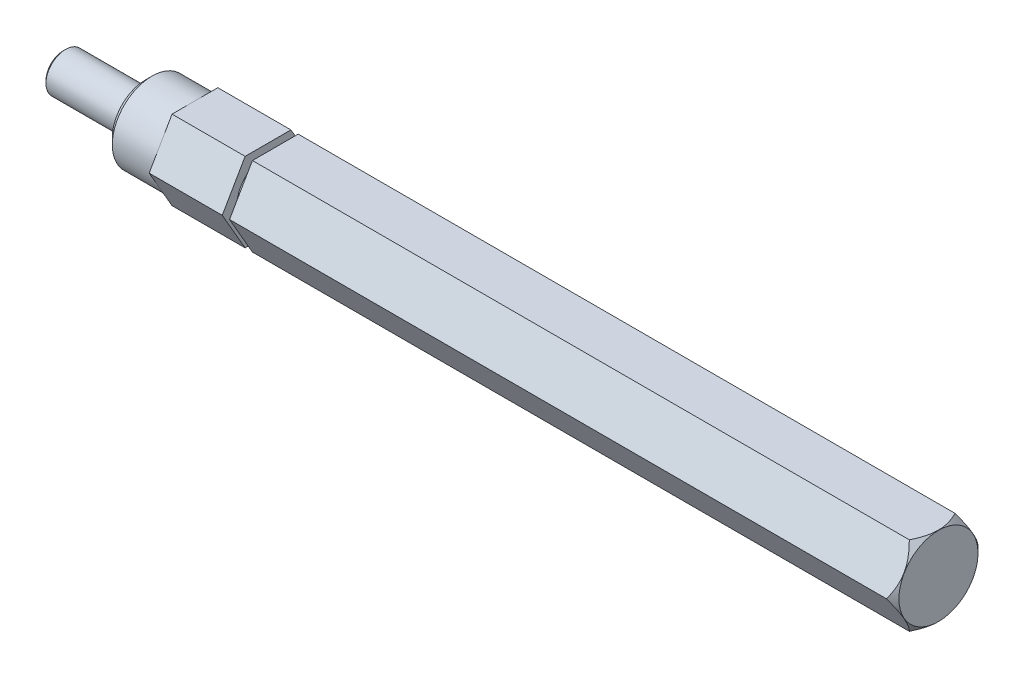
ISO-10303-21;
HEADER;
FILE_DESCRIPTION(('STEP AP214'),'2;1');
FILE_NAME('part.step','',(''),(''),'','','');
FILE_SCHEMA(('AUTOMOTIVE_DESIGN { 1 0 10303 214 1 1 1 1 }'));
ENDSEC;
DATA;
#1=APPLICATION_CONTEXT('core data for automotive mechanical design processes');
#2=APPLICATION_PROTOCOL_DEFINITION('international standard','automotive_design',2000,#1);
#3=PRODUCT_CONTEXT('',#1,'mechanical');
#4=PRODUCT('Part','Part','',(#3));
#5=PRODUCT_RELATED_PRODUCT_CATEGORY('part','',(#4));
#6=PRODUCT_DEFINITION_FORMATION('','',#4);
#7=PRODUCT_DEFINITION_CONTEXT('part definition',#1,'design');
#8=PRODUCT_DEFINITION('design','',#6,#7);
#9=PRODUCT_DEFINITION_SHAPE('','',#8);
#10=(LENGTH_UNIT() NAMED_UNIT(*) SI_UNIT(.MILLI.,.METRE.));
#11=(NAMED_UNIT(*) PLANE_ANGLE_UNIT() SI_UNIT($,.RADIAN.));
#12=(NAMED_UNIT(*) SI_UNIT($,.STERADIAN.) SOLID_ANGLE_UNIT());
#13=UNCERTAINTY_MEASURE_WITH_UNIT(LENGTH_MEASURE(1.E-05),#10,'distance_accuracy_value','');
#14=(GEOMETRIC_REPRESENTATION_CONTEXT(3) GLOBAL_UNCERTAINTY_ASSIGNED_CONTEXT((#13)) GLOBAL_UNIT_ASSIGNED_CONTEXT((#10,
#11,#12)) REPRESENTATION_CONTEXT('',''));
#15=CARTESIAN_POINT('',(0.,0.,0.));
#16=DIRECTION('',(0.,0.,1.));
#17=DIRECTION('',(1.,0.,0.));
#18=AXIS2_PLACEMENT_3D('',#15,#16,#17);
#19=CARTESIAN_POINT('',(-76.708,0.,0.));
#20=DIRECTION('',(-1.,0.,0.));
#21=DIRECTION('',(0.,0.,1.));
#22=AXIS2_PLACEMENT_3D('',#19,#20,#21);
#23=PLANE('',#22);
#24=CARTESIAN_POINT('',(-76.7079999999964,0.,0.));
#25=DIRECTION('',(1.,0.,0.));
#26=DIRECTION('',(0.,0.,-1.));
#27=AXIS2_PLACEMENT_3D('',#24,#25,#26);
#28=CIRCLE('',#27,2.76860000002443);
#29=CARTESIAN_POINT('',(-76.7079999999964,0.,-2.76860000002443));
#30=VERTEX_POINT('',#29);
#31=EDGE_CURVE('E21',#30,#30,#28,.T.);
#32=ORIENTED_EDGE('',*,*,#31,.F.);
#33=EDGE_LOOP('',(#32));
#34=FACE_BOUND('',#33,.T.);
#35=ADVANCED_FACE('F18',(#34),#23,.T.);
#36=CARTESIAN_POINT('',(-76.326999999992,0.,0.));
#37=DIRECTION('',(1.,0.,0.));
#38=DIRECTION('',(0.,0.,-1.));
#39=AXIS2_PLACEMENT_3D('',#36,#37,#38);
#40=CONICAL_SURFACE('',#39,3.149599999972,0.785398163322851);
#41=ORIENTED_EDGE('',*,*,#31,.T.);
#42=EDGE_LOOP('',(#41));
#43=FACE_BOUND('',#42,.T.);
#44=CARTESIAN_POINT('',(-76.327,0.,0.));
#45=DIRECTION('',(1.,0.,0.));
#46=DIRECTION('',(0.,0.,-1.));
#47=AXIS2_PLACEMENT_3D('',#44,#45,#46);
#48=CIRCLE('',#47,3.1496);
#49=CARTESIAN_POINT('',(-76.327,0.,-3.1496));
#50=VERTEX_POINT('',#49);
#51=EDGE_CURVE('E134',#50,#50,#48,.T.);
#52=ORIENTED_EDGE('',*,*,#51,.F.);
#53=EDGE_LOOP('',(#52));
#54=FACE_BOUND('',#53,.T.);
#55=ADVANCED_FACE('F260',(#43,#54),#40,.T.);
#56=CARTESIAN_POINT('',(-76.708,0.,0.));
#57=DIRECTION('',(1.,0.,0.));
#58=DIRECTION('',(0.,0.,-1.));
#59=AXIS2_PLACEMENT_3D('',#56,#57,#58);
#60=CYLINDRICAL_SURFACE('',#59,3.1496);
#61=ORIENTED_EDGE('',*,*,#51,.T.);
#62=EDGE_LOOP('',(#61));
#63=FACE_BOUND('',#62,.T.);
#64=CARTESIAN_POINT('',(-63.5,0.,0.));
#65=DIRECTION('',(1.,0.,0.));
#66=DIRECTION('',(0.,0.,-1.));
#67=AXIS2_PLACEMENT_3D('',#64,#65,#66);
#68=CIRCLE('',#67,3.1496);
#69=CARTESIAN_POINT('',(-63.5,0.,-3.1496));
#70=VERTEX_POINT('',#69);
#71=EDGE_CURVE('E137',#70,#70,#68,.F.);
#72=ORIENTED_EDGE('',*,*,#71,.T.);
#73=EDGE_LOOP('',(#72));
#74=FACE_BOUND('',#73,.T.);
#75=ADVANCED_FACE('F257',(#63,#74),#60,.T.);
#76=CARTESIAN_POINT('',(-63.5,0.,-7.33234841870824));
#77=DIRECTION('',(1.,0.,0.));
#78=DIRECTION('',(0.,0.,-1.));
#79=AXIS2_PLACEMENT_3D('',#76,#77,#78);
#80=PLANE('',#79);
#81=ORIENTED_EDGE('',*,*,#71,.F.);
#82=EDGE_LOOP('',(#81));
#83=FACE_BOUND('',#82,.T.);
#84=CARTESIAN_POINT('',(-63.4999999999764,0.,0.));
#85=DIRECTION('',(1.,0.,0.));
#86=DIRECTION('',(0.,0.,-1.));
#87=AXIS2_PLACEMENT_3D('',#84,#85,#86);
#88=CIRCLE('',#87,5.35000000002128);
#89=CARTESIAN_POINT('',(-63.4999999999764,0.,-5.35000000002128));
#90=VERTEX_POINT('',#89);
#91=EDGE_CURVE('E133',#90,#90,#88,.T.);
#92=ORIENTED_EDGE('',*,*,#91,.F.);
#93=EDGE_LOOP('',(#92));
#94=FACE_BOUND('',#93,.T.);
#95=ADVANCED_FACE('F253',(#83,#94),#80,.F.);
#96=CARTESIAN_POINT('',(-62.5000000001137,0.,0.));
#97=DIRECTION('',(1.,0.,0.));
#98=DIRECTION('',(0.,0.,-1.));
#99=AXIS2_PLACEMENT_3D('',#96,#97,#98);
#100=CONICAL_SURFACE('',#99,6.34999999988395,0.785398163397448);
#101=ORIENTED_EDGE('',*,*,#91,.T.);
#102=EDGE_LOOP('',(#101));
#103=FACE_BOUND('',#102,.T.);
#104=CARTESIAN_POINT('',(-62.5,0.,0.));
#105=DIRECTION('',(-1.,0.,0.));
#106=DIRECTION('',(0.,0.,1.));
#107=AXIS2_PLACEMENT_3D('',#104,#105,#106);
#108=CIRCLE('',#107,6.35);
#109=CARTESIAN_POINT('',(-62.5,0.,6.35));
#110=VERTEX_POINT('',#109);
#111=EDGE_CURVE('E97',#110,#110,#108,.F.);
#112=ORIENTED_EDGE('',*,*,#111,.F.);
#113=EDGE_LOOP('',(#112));
#114=FACE_BOUND('',#113,.T.);
#115=ADVANCED_FACE('F250',(#103,#114),#100,.T.);
#116=CARTESIAN_POINT('',(-55.6133,0.,0.));
#117=DIRECTION('',(-1.,0.,0.));
#118=DIRECTION('',(0.,0.,1.));
#119=AXIS2_PLACEMENT_3D('',#116,#117,#118);
#120=CYLINDRICAL_SURFACE('',#119,6.35);
#121=CARTESIAN_POINT('',(-55.6133,0.,0.));
#122=DIRECTION('',(-1.,0.,0.));
#123=DIRECTION('',(0.,0.,1.));
#124=AXIS2_PLACEMENT_3D('',#121,#122,#123);
#125=CIRCLE('',#124,6.35);
#126=CARTESIAN_POINT('',(-55.6133,-3.17499999999999,-5.49926131403119));
#127=VERTEX_POINT('',#126);
#128=CARTESIAN_POINT('',(-55.6133,3.175,-5.49926131403119));
#129=VERTEX_POINT('',#128);
#130=EDGE_CURVE('E83',#127,#129,#125,.F.);
#131=ORIENTED_EDGE('',*,*,#130,.F.);
#132=CARTESIAN_POINT('',(-55.6133,0.,0.));
#133=DIRECTION('',(-1.,0.,0.));
#134=DIRECTION('',(0.,0.,1.));
#135=AXIS2_PLACEMENT_3D('',#132,#133,#134);
#136=CIRCLE('',#135,6.35);
#137=CARTESIAN_POINT('',(-55.6133,-6.35000000000001,0.));
#138=VERTEX_POINT('',#137);
#139=EDGE_CURVE('E92',#138,#127,#136,.F.);
#140=ORIENTED_EDGE('',*,*,#139,.F.);
#141=CARTESIAN_POINT('',(-55.6133,0.,0.));
#142=DIRECTION('',(-1.,0.,0.));
#143=DIRECTION('',(0.,0.,1.));
#144=AXIS2_PLACEMENT_3D('',#141,#142,#143);
#145=CIRCLE('',#144,6.35);
#146=CARTESIAN_POINT('',(-55.6133,-3.175,5.49926131403118));
#147=VERTEX_POINT('',#146);
#148=EDGE_CURVE('E107',#147,#138,#145,.F.);
#149=ORIENTED_EDGE('',*,*,#148,.F.);
#150=CARTESIAN_POINT('',(-55.6133,0.,0.));
#151=DIRECTION('',(-1.,0.,0.));
#152=DIRECTION('',(0.,0.,1.));
#153=AXIS2_PLACEMENT_3D('',#150,#151,#152);
#154=CIRCLE('',#153,6.35);
#155=CARTESIAN_POINT('',(-55.6133,3.17499999999999,5.49926131403118));
#156=VERTEX_POINT('',#155);
#157=EDGE_CURVE('E108',#156,#147,#154,.F.);
#158=ORIENTED_EDGE('',*,*,#157,.F.);
#159=CARTESIAN_POINT('',(-55.6133,0.,0.));
#160=DIRECTION('',(-1.,0.,0.));
#161=DIRECTION('',(0.,0.,1.));
#162=AXIS2_PLACEMENT_3D('',#159,#160,#161);
#163=CIRCLE('',#162,6.35);
#164=CARTESIAN_POINT('',(-55.6133,6.35,0.));
#165=VERTEX_POINT('',#164);
#166=EDGE_CURVE('E457',#165,#156,#163,.F.);
#167=ORIENTED_EDGE('',*,*,#166,.F.);
#168=CARTESIAN_POINT('',(-55.6133,0.,0.));
#169=DIRECTION('',(-1.,0.,0.));
#170=DIRECTION('',(0.,0.,1.));
#171=AXIS2_PLACEMENT_3D('',#168,#169,#170);
#172=CIRCLE('',#171,6.35);
#173=EDGE_CURVE('E95',#129,#165,#172,.F.);
#174=ORIENTED_EDGE('',*,*,#173,.F.);
#175=EDGE_LOOP('',(#131,#140,#149,#158,#167,#174));
#176=FACE_BOUND('',#175,.T.);
#177=ORIENTED_EDGE('',*,*,#111,.T.);
#178=EDGE_LOOP('',(#177));
#179=FACE_BOUND('',#178,.T.);
#180=ADVANCED_FACE('F89',(#176,#179),#120,.T.);
#181=CARTESIAN_POINT('',(-55.6133,0.,0.));
#182=DIRECTION('',(-1.,0.,0.));
#183=DIRECTION('',(0.,0.,1.));
#184=AXIS2_PLACEMENT_3D('',#181,#182,#183);
#185=PLANE('',#184);
#186=DIRECTION('',(0.,-0.86602540378444,0.499999999999998));
#187=VECTOR('',#186,1.);
#188=CARTESIAN_POINT('',(-55.6133,-6.35000000000002,-3.66617420935411));
#189=LINE('',#188,#187);
#190=CARTESIAN_POINT('',(-55.6133000000001,0.,-7.33234841870823));
#191=VERTEX_POINT('',#190);
#192=EDGE_CURVE('E114',#191,#127,#189,.T.);
#193=ORIENTED_EDGE('',*,*,#192,.T.);
#194=ORIENTED_EDGE('',*,*,#130,.T.);
#195=DIRECTION('',(0.,-0.866025403784439,-0.5));
#196=VECTOR('',#195,1.);
#197=CARTESIAN_POINT('',(-55.6133000000001,0.,-7.33234841870824));
#198=LINE('',#197,#196);
#199=EDGE_CURVE('E122',#129,#191,#198,.T.);
#200=ORIENTED_EDGE('',*,*,#199,.T.);
#201=EDGE_LOOP('',(#193,#194,#200));
#202=FACE_BOUND('',#201,.T.);
#203=ADVANCED_FACE('F121',(#202),#185,.T.);
#204=CARTESIAN_POINT('',(-55.6133,0.,0.));
#205=DIRECTION('',(-1.,0.,0.));
#206=DIRECTION('',(0.,0.,1.));
#207=AXIS2_PLACEMENT_3D('',#204,#205,#206);
#208=PLANE('',#207);
#209=DIRECTION('',(0.,-0.866025403784439,-0.5));
#210=VECTOR('',#209,1.);
#211=CARTESIAN_POINT('',(-55.6133000000001,0.,-7.33234841870824));
#212=LINE('',#211,#210);
#213=CARTESIAN_POINT('',(-55.6133,6.35000000000001,-3.66617420935409));
#214=VERTEX_POINT('',#213);
#215=EDGE_CURVE('E119',#214,#129,#212,.T.);
#216=ORIENTED_EDGE('',*,*,#215,.T.);
#217=ORIENTED_EDGE('',*,*,#173,.T.);
#218=DIRECTION('',(0.,0.,-1.));
#219=VECTOR('',#218,1.);
#220=CARTESIAN_POINT('',(-55.6133,6.35,-3.66617420935412));
#221=LINE('',#220,#219);
#222=EDGE_CURVE('E416',#165,#214,#221,.T.);
#223=ORIENTED_EDGE('',*,*,#222,.T.);
#224=EDGE_LOOP('',(#216,#217,#223));
#225=FACE_BOUND('',#224,.T.);
#226=ADVANCED_FACE('F241',(#225),#208,.T.);
#227=CARTESIAN_POINT('',(-55.6133,0.,0.));
#228=DIRECTION('',(-1.,0.,0.));
#229=DIRECTION('',(0.,0.,1.));
#230=AXIS2_PLACEMENT_3D('',#227,#228,#229);
#231=PLANE('',#230);
#232=ORIENTED_EDGE('',*,*,#166,.T.);
#233=DIRECTION('',(0.,0.866025403784439,-0.499999999999999));
#234=VECTOR('',#233,1.);
#235=CARTESIAN_POINT('',(-55.6133,6.35,3.6661742093541));
#236=LINE('',#235,#234);
#237=CARTESIAN_POINT('',(-55.6133,6.34999999999999,3.66617420935411));
#238=VERTEX_POINT('',#237);
#239=EDGE_CURVE('E401',#156,#238,#236,.T.);
#240=ORIENTED_EDGE('',*,*,#239,.T.);
#241=DIRECTION('',(0.,0.,-1.));
#242=VECTOR('',#241,1.);
#243=CARTESIAN_POINT('',(-55.6133,6.35,-3.66617420935412));
#244=LINE('',#243,#242);
#245=EDGE_CURVE('E413',#238,#165,#244,.T.);
#246=ORIENTED_EDGE('',*,*,#245,.T.);
#247=EDGE_LOOP('',(#232,#240,#246));
#248=FACE_BOUND('',#247,.T.);
#249=ADVANCED_FACE('F237',(#248),#231,.T.);
#250=CARTESIAN_POINT('',(-55.6133,0.,0.));
#251=DIRECTION('',(-1.,0.,0.));
#252=DIRECTION('',(0.,0.,1.));
#253=AXIS2_PLACEMENT_3D('',#250,#251,#252);
#254=PLANE('',#253);
#255=ORIENTED_EDGE('',*,*,#157,.T.);
#256=DIRECTION('',(0.,0.866025403784439,0.5));
#257=VECTOR('',#256,1.);
#258=CARTESIAN_POINT('',(-55.6133000000001,0.,7.33234841870822));
#259=LINE('',#258,#257);
#260=CARTESIAN_POINT('',(-55.6133000000001,0.,7.33234841870822));
#261=VERTEX_POINT('',#260);
#262=EDGE_CURVE('E372',#147,#261,#259,.T.);
#263=ORIENTED_EDGE('',*,*,#262,.T.);
#264=DIRECTION('',(0.,0.866025403784439,-0.499999999999999));
#265=VECTOR('',#264,1.);
#266=CARTESIAN_POINT('',(-55.6133,6.35,3.6661742093541));
#267=LINE('',#266,#265);
#268=EDGE_CURVE('E398',#261,#156,#267,.T.);
#269=ORIENTED_EDGE('',*,*,#268,.T.);
#270=EDGE_LOOP('',(#255,#263,#269));
#271=FACE_BOUND('',#270,.T.);
#272=ADVANCED_FACE('F234',(#271),#254,.T.);
#273=CARTESIAN_POINT('',(-55.6133,0.,0.));
#274=DIRECTION('',(-1.,0.,0.));
#275=DIRECTION('',(0.,0.,1.));
#276=AXIS2_PLACEMENT_3D('',#273,#274,#275);
#277=PLANE('',#276);
#278=DIRECTION('',(0.,0.,1.));
#279=VECTOR('',#278,1.);
#280=CARTESIAN_POINT('',(-55.6133,-6.35000000000002,3.66617420935409));
#281=LINE('',#280,#279);
#282=CARTESIAN_POINT('',(-55.6133,-6.35000000000003,-3.6661742093541));
#283=VERTEX_POINT('',#282);
#284=EDGE_CURVE('E106',#283,#138,#281,.T.);
#285=ORIENTED_EDGE('',*,*,#284,.T.);
#286=ORIENTED_EDGE('',*,*,#139,.T.);
#287=DIRECTION('',(0.,-0.86602540378444,0.499999999999998));
#288=VECTOR('',#287,1.);
#289=CARTESIAN_POINT('',(-55.6133,-6.35000000000002,-3.66617420935411));
#290=LINE('',#289,#288);
#291=EDGE_CURVE('E104',#127,#283,#290,.T.);
#292=ORIENTED_EDGE('',*,*,#291,.T.);
#293=EDGE_LOOP('',(#285,#286,#292));
#294=FACE_BOUND('',#293,.T.);
#295=ADVANCED_FACE('F103',(#294),#277,.T.);
#296=CARTESIAN_POINT('',(-55.6133,0.,0.));
#297=DIRECTION('',(-1.,0.,0.));
#298=DIRECTION('',(0.,0.,1.));
#299=AXIS2_PLACEMENT_3D('',#296,#297,#298);
#300=PLANE('',#299);
#301=ORIENTED_EDGE('',*,*,#148,.T.);
#302=DIRECTION('',(0.,0.,1.));
#303=VECTOR('',#302,1.);
#304=CARTESIAN_POINT('',(-55.6133,-6.35000000000002,3.66617420935409));
#305=LINE('',#304,#303);
#306=CARTESIAN_POINT('',(-55.6133,-6.35000000000002,3.66617420935407));
#307=VERTEX_POINT('',#306);
#308=EDGE_CURVE('E357',#138,#307,#305,.T.);
#309=ORIENTED_EDGE('',*,*,#308,.T.);
#310=DIRECTION('',(0.,0.866025403784439,0.5));
#311=VECTOR('',#310,1.);
#312=CARTESIAN_POINT('',(-55.6133000000001,0.,7.33234841870822));
#313=LINE('',#312,#311);
#314=EDGE_CURVE('E369',#307,#147,#313,.T.);
#315=ORIENTED_EDGE('',*,*,#314,.T.);
#316=EDGE_LOOP('',(#301,#309,#315));
#317=FACE_BOUND('',#316,.T.);
#318=ADVANCED_FACE('F228',(#317),#300,.T.);
#319=CARTESIAN_POINT('',(63.5,-6.35000000000002,-3.66617420935411));
#320=DIRECTION('',(0.,0.499999999999998,0.86602540378444));
#321=DIRECTION('',(0.,-0.86602540378444,0.499999999999998));
#322=AXIS2_PLACEMENT_3D('',#319,#320,#321);
#323=PLANE('',#322);
#324=DIRECTION('',(1.,0.,0.));
#325=VECTOR('',#324,1.);
#326=CARTESIAN_POINT('',(63.5,-6.35000000000002,-3.66617420935411));
#327=LINE('',#326,#325);
#328=CARTESIAN_POINT('',(-43.9039,-6.35000000000002,-3.66617420935411));
#329=VERTEX_POINT('',#328);
#330=EDGE_CURVE('E118',#329,#283,#327,.F.);
#331=ORIENTED_EDGE('',*,*,#330,.T.);
#332=ORIENTED_EDGE('',*,*,#291,.F.);
#333=ORIENTED_EDGE('',*,*,#192,.F.);
#334=DIRECTION('',(1.,0.,0.));
#335=VECTOR('',#334,1.);
#336=CARTESIAN_POINT('',(63.5,0.,-7.33234841870822));
#337=LINE('',#336,#335);
#338=CARTESIAN_POINT('',(-43.9039,0.,-7.33234841870823));
#339=VERTEX_POINT('',#338);
#340=EDGE_CURVE('E417',#191,#339,#337,.T.);
#341=ORIENTED_EDGE('',*,*,#340,.T.);
#342=DIRECTION('',(0.,0.86602540378444,-0.499999999999999));
#343=VECTOR('',#342,1.);
#344=CARTESIAN_POINT('',(-43.9039,-6.35000000000002,-3.66617420935411));
#345=LINE('',#344,#343);
#346=EDGE_CURVE('E355',#329,#339,#345,.T.);
#347=ORIENTED_EDGE('',*,*,#346,.F.);
#348=EDGE_LOOP('',(#331,#332,#333,#341,#347));
#349=FACE_BOUND('',#348,.T.);
#350=ADVANCED_FACE('F112',(#349),#323,.F.);
#351=CARTESIAN_POINT('',(63.5,0.,-7.33234841870824));
#352=DIRECTION('',(0.,-0.5,0.866025403784439));
#353=DIRECTION('',(0.,-0.866025403784439,-0.5));
#354=AXIS2_PLACEMENT_3D('',#351,#352,#353);
#355=PLANE('',#354);
#356=ORIENTED_EDGE('',*,*,#340,.F.);
#357=ORIENTED_EDGE('',*,*,#199,.F.);
#358=ORIENTED_EDGE('',*,*,#215,.F.);
#359=DIRECTION('',(1.,0.,0.));
#360=VECTOR('',#359,1.);
#361=CARTESIAN_POINT('',(63.5,6.35,-3.66617420935407));
#362=LINE('',#361,#360);
#363=CARTESIAN_POINT('',(-43.9039,6.35,-3.66617420935411));
#364=VERTEX_POINT('',#363);
#365=EDGE_CURVE('E402',#214,#364,#362,.T.);
#366=ORIENTED_EDGE('',*,*,#365,.T.);
#367=DIRECTION('',(0.,0.866025403784439,0.499999999999999));
#368=VECTOR('',#367,1.);
#369=CARTESIAN_POINT('',(-43.9039,0.,-7.33234841870824));
#370=LINE('',#369,#368);
#371=EDGE_CURVE('E352',#339,#364,#370,.T.);
#372=ORIENTED_EDGE('',*,*,#371,.F.);
#373=EDGE_LOOP('',(#356,#357,#358,#366,#372));
#374=FACE_BOUND('',#373,.T.);
#375=ADVANCED_FACE('F221',(#374),#355,.F.);
#376=CARTESIAN_POINT('',(63.5,6.35,-3.66617420935412));
#377=DIRECTION('',(0.,-1.,0.));
#378=DIRECTION('',(0.,0.,-1.));
#379=AXIS2_PLACEMENT_3D('',#376,#377,#378);
#380=PLANE('',#379);
#381=ORIENTED_EDGE('',*,*,#365,.F.);
#382=ORIENTED_EDGE('',*,*,#222,.F.);
#383=ORIENTED_EDGE('',*,*,#245,.F.);
#384=DIRECTION('',(1.,0.,0.));
#385=VECTOR('',#384,1.);
#386=CARTESIAN_POINT('',(63.5,6.34999999999997,3.66617420935412));
#387=LINE('',#386,#385);
#388=CARTESIAN_POINT('',(-43.9039,6.34999999999999,3.6661742093541));
#389=VERTEX_POINT('',#388);
#390=EDGE_CURVE('E373',#238,#389,#387,.T.);
#391=ORIENTED_EDGE('',*,*,#390,.T.);
#392=DIRECTION('',(0.,0.,-1.));
#393=VECTOR('',#392,1.);
#394=CARTESIAN_POINT('',(-43.9039,6.35,0.));
#395=LINE('',#394,#393);
#396=EDGE_CURVE('E349',#364,#389,#395,.F.);
#397=ORIENTED_EDGE('',*,*,#396,.F.);
#398=EDGE_LOOP('',(#381,#382,#383,#391,#397));
#399=FACE_BOUND('',#398,.T.);
#400=ADVANCED_FACE('F217',(#399),#380,.F.);
#401=CARTESIAN_POINT('',(63.5,6.35,3.6661742093541));
#402=DIRECTION('',(0.,-0.499999999999999,-0.866025403784439));
#403=DIRECTION('',(0.,0.866025403784439,-0.499999999999999));
#404=AXIS2_PLACEMENT_3D('',#401,#402,#403);
#405=PLANE('',#404);
#406=ORIENTED_EDGE('',*,*,#390,.F.);
#407=ORIENTED_EDGE('',*,*,#239,.F.);
#408=ORIENTED_EDGE('',*,*,#268,.F.);
#409=DIRECTION('',(1.,0.,0.));
#410=VECTOR('',#409,1.);
#411=CARTESIAN_POINT('',(63.5,0.,7.33234841870822));
#412=LINE('',#411,#410);
#413=CARTESIAN_POINT('',(-43.9039,0.,7.33234841870822));
#414=VERTEX_POINT('',#413);
#415=EDGE_CURVE('E377',#261,#414,#412,.T.);
#416=ORIENTED_EDGE('',*,*,#415,.T.);
#417=DIRECTION('',(0.,-0.866025403784439,0.499999999999999));
#418=VECTOR('',#417,1.);
#419=CARTESIAN_POINT('',(-43.9039,6.35,3.6661742093541));
#420=LINE('',#419,#418);
#421=EDGE_CURVE('E346',#389,#414,#420,.T.);
#422=ORIENTED_EDGE('',*,*,#421,.F.);
#423=EDGE_LOOP('',(#406,#407,#408,#416,#422));
#424=FACE_BOUND('',#423,.T.);
#425=ADVANCED_FACE('F213',(#424),#405,.F.);
#426=CARTESIAN_POINT('',(63.5,0.,7.33234841870822));
#427=DIRECTION('',(0.,0.5,-0.866025403784439));
#428=DIRECTION('',(0.,0.866025403784439,0.5));
#429=AXIS2_PLACEMENT_3D('',#426,#427,#428);
#430=PLANE('',#429);
#431=ORIENTED_EDGE('',*,*,#415,.F.);
#432=ORIENTED_EDGE('',*,*,#262,.F.);
#433=ORIENTED_EDGE('',*,*,#314,.F.);
#434=DIRECTION('',(1.,0.,0.));
#435=VECTOR('',#434,1.);
#436=CARTESIAN_POINT('',(63.5,-6.35000000000002,3.66617420935404));
#437=LINE('',#436,#435);
#438=CARTESIAN_POINT('',(-43.9039,-6.35000000000002,3.66617420935408));
#439=VERTEX_POINT('',#438);
#440=EDGE_CURVE('E362',#307,#439,#437,.T.);
#441=ORIENTED_EDGE('',*,*,#440,.T.);
#442=DIRECTION('',(0.,-0.866025403784439,-0.5));
#443=VECTOR('',#442,1.);
#444=CARTESIAN_POINT('',(-43.9039,0.,7.33234841870822));
#445=LINE('',#444,#443);
#446=EDGE_CURVE('E342',#414,#439,#445,.T.);
#447=ORIENTED_EDGE('',*,*,#446,.F.);
#448=EDGE_LOOP('',(#431,#432,#433,#441,#447));
#449=FACE_BOUND('',#448,.T.);
#450=ADVANCED_FACE('F209',(#449),#430,.F.);
#451=CARTESIAN_POINT('',(63.5,-6.35000000000002,3.66617420935409));
#452=DIRECTION('',(0.,1.,0.));
#453=DIRECTION('',(0.,0.,1.));
#454=AXIS2_PLACEMENT_3D('',#451,#452,#453);
#455=PLANE('',#454);
#456=ORIENTED_EDGE('',*,*,#440,.F.);
#457=ORIENTED_EDGE('',*,*,#308,.F.);
#458=ORIENTED_EDGE('',*,*,#284,.F.);
#459=ORIENTED_EDGE('',*,*,#330,.F.);
#460=DIRECTION('',(0.,0.,-1.));
#461=VECTOR('',#460,1.);
#462=CARTESIAN_POINT('',(-43.9039,-6.35000000000001,0.));
#463=LINE('',#462,#461);
#464=EDGE_CURVE('E345',#439,#329,#463,.T.);
#465=ORIENTED_EDGE('',*,*,#464,.F.);
#466=EDGE_LOOP('',(#456,#457,#458,#459,#465));
#467=FACE_BOUND('',#466,.T.);
#468=ADVANCED_FACE('F205',(#467),#455,.F.);
#469=CARTESIAN_POINT('',(-43.9039,7.5692,0.));
#470=DIRECTION('',(1.,0.,0.));
#471=DIRECTION('',(0.,0.,-1.));
#472=AXIS2_PLACEMENT_3D('',#469,#470,#471);
#473=PLANE('',#472);
#474=ORIENTED_EDGE('',*,*,#446,.T.);
#475=ORIENTED_EDGE('',*,*,#464,.T.);
#476=ORIENTED_EDGE('',*,*,#346,.T.);
#477=ORIENTED_EDGE('',*,*,#371,.T.);
#478=ORIENTED_EDGE('',*,*,#396,.T.);
#479=ORIENTED_EDGE('',*,*,#421,.T.);
#480=EDGE_LOOP('',(#474,#475,#476,#477,#478,#479));
#481=FACE_BOUND('',#480,.T.);
#482=CARTESIAN_POINT('',(-43.9039,0.,0.));
#483=DIRECTION('',(-1.,0.,0.));
#484=DIRECTION('',(0.,0.,1.));
#485=AXIS2_PLACEMENT_3D('',#482,#483,#484);
#486=CIRCLE('',#485,5.0292);
#487=CARTESIAN_POINT('',(-43.9039,0.,5.0292));
#488=VERTEX_POINT('',#487);
#489=EDGE_CURVE('E190',#488,#488,#486,.F.);
#490=ORIENTED_EDGE('',*,*,#489,.F.);
#491=EDGE_LOOP('',(#490));
#492=FACE_BOUND('',#491,.T.);
#493=ADVANCED_FACE('F201',(#481,#492),#473,.T.);
#494=CARTESIAN_POINT('',(-78.984221990192,0.,0.));
#495=DIRECTION('',(-1.,0.,0.));
#496=DIRECTION('',(0.,0.,1.));
#497=AXIS2_PLACEMENT_3D('',#494,#495,#496);
#498=CYLINDRICAL_SURFACE('',#497,5.0292);
#499=CARTESIAN_POINT('',(-42.7355,0.,0.));
#500=DIRECTION('',(-1.,0.,0.));
#501=DIRECTION('',(0.,0.,1.));
#502=AXIS2_PLACEMENT_3D('',#499,#500,#501);
#503=CIRCLE('',#502,5.0292);
#504=CARTESIAN_POINT('',(-42.7355,0.,5.0292));
#505=VERTEX_POINT('',#504);
#506=EDGE_CURVE('E321',#505,#505,#503,.F.);
#507=ORIENTED_EDGE('',*,*,#506,.F.);
#508=EDGE_LOOP('',(#507));
#509=FACE_BOUND('',#508,.T.);
#510=ORIENTED_EDGE('',*,*,#489,.T.);
#511=EDGE_LOOP('',(#510));
#512=FACE_BOUND('',#511,.T.);
#513=ADVANCED_FACE('F197',(#509,#512),#498,.T.);
#514=CARTESIAN_POINT('',(63.5,-6.35000000000002,-3.66617420935411));
#515=DIRECTION('',(0.,0.499999999999998,0.86602540378444));
#516=DIRECTION('',(0.,-0.86602540378444,0.499999999999998));
#517=AXIS2_PLACEMENT_3D('',#514,#515,#516);
#518=PLANE('',#517);
#519=CARTESIAN_POINT('',(62.5000000000251,-6.35000000001246,-3.66617420934361));
#520=CARTESIAN_POINT('',(62.5630243488132,-6.24082224128489,-3.72920801773658));
#521=CARTESIAN_POINT('',(62.6241144550649,-6.13080532071175,-3.79272631644579));
#522=CARTESIAN_POINT('',(62.7418378426297,-5.90892855599337,-3.92082692628354));
#523=CARTESIAN_POINT('',(62.7984686901009,-5.79706774518944,-3.98540979551274));
#524=CARTESIAN_POINT('',(62.9612726486637,-5.45743359870881,-4.18149766140897));
#525=CARTESIAN_POINT('',(63.0596627844808,-5.22678528314502,-4.31466252848803));
#526=CARTESIAN_POINT('',(63.2281485575353,-4.76166466154775,-4.58320004457298));
#527=CARTESIAN_POINT('',(63.2986686148327,-4.52731120638811,-4.71850407499486));
#528=CARTESIAN_POINT('',(63.3802425803222,-4.17192864306111,-4.92368429359699));
#529=CARTESIAN_POINT('',(63.4033886424388,-4.05294462116126,-4.99237975067014));
#530=CARTESIAN_POINT('',(63.4410883456707,-3.81396926695451,-5.1303522357511));
#531=CARTESIAN_POINT('',(63.4556432705364,-3.69397808786349,-5.19962917529968));
#532=CARTESIAN_POINT('',(63.4800473333972,-3.40156567352281,-5.36845356143365));
#533=CARTESIAN_POINT('',(63.4851670463065,-3.22882935730444,-5.46818292010115));
#534=CARTESIAN_POINT('',(63.4765691176406,-2.88366816817396,-5.66746182555945));
#535=CARTESIAN_POINT('',(63.4628448734034,-2.71124342563288,-5.76701129708049));
#536=CARTESIAN_POINT('',(63.4173680224393,-2.36801965567892,-5.96517163305569));
#537=CARTESIAN_POINT('',(63.3855952591375,-2.19722266334729,-6.06378132255513));
#538=CARTESIAN_POINT('',(63.3057487124252,-1.85856430449202,-6.25930581720353));
#539=CARTESIAN_POINT('',(63.257676179171,-1.69070271386755,-6.35622075173717));
#540=CARTESIAN_POINT('',(63.1587833928241,-1.39273873571613,-6.5282503347317));
#541=CARTESIAN_POINT('',(63.1105654677278,-1.26197616672401,-6.60374613913923));
#542=CARTESIAN_POINT('',(63.0063605790637,-1.00279800721751,-6.75338271929838));
#543=CARTESIAN_POINT('',(62.9503733812648,-0.874382487595074,-6.82752345412052));
#544=CARTESIAN_POINT('',(62.8318846841198,-0.620302927697594,-6.97421635642291));
#545=CARTESIAN_POINT('',(62.7694036729165,-0.494631661690769,-7.04677269568135));
#546=CARTESIAN_POINT('',(62.6387473881741,-0.245615832684075,-7.19054205159085));
#547=CARTESIAN_POINT('',(62.57057560442,-0.122269899780851,-7.26175585915597));
#548=CARTESIAN_POINT('',(62.5000000000243,1.80847613580905E-11,-7.33234841871867));
#549=B_SPLINE_CURVE_WITH_KNOTS('',3,(#519,#520,#521,#522,#523,#524,#525,#526,#527,#528,#529,
#530,#531,#532,#533,#534,#535,#536,#537,#538,#539,#540,#541,#542,#543,#544,#545,#546,#547,#548),
.UNSPECIFIED.,.F.,.F.,(4,2,2,2,2,2,2,2,2,2,2,2,2,2,4),(0.,0.422806209108107,0.845841606931463,
1.69647868442686,2.53361052128564,2.95135562071456,3.36903828181059,3.96668147991982,
4.56453413738439,5.16305579271073,5.7615315531297,6.23681974407244,6.71212226731044,
7.18596827579814,7.6595258100969),.UNSPECIFIED.);
#550=CARTESIAN_POINT('',(62.5000000000306,-6.35000000000723,-3.66617420934995));
#551=VERTEX_POINT('',#550);
#552=CARTESIAN_POINT('',(62.4999999999147,0.,-7.33234841873404));
#553=VERTEX_POINT('',#552);
#554=EDGE_CURVE('E183',#551,#553,#549,.T.);
#555=ORIENTED_EDGE('',*,*,#554,.F.);
#556=DIRECTION('',(1.,0.,0.));
#557=VECTOR('',#556,1.);
#558=CARTESIAN_POINT('',(63.5,-6.35000000000002,-3.66617420935411));
#559=LINE('',#558,#557);
#560=CARTESIAN_POINT('',(-42.7355,-6.35000000000002,-3.66617420935411));
#561=VERTEX_POINT('',#560);
#562=EDGE_CURVE('E318',#551,#561,#559,.F.);
#563=ORIENTED_EDGE('',*,*,#562,.T.);
#564=DIRECTION('',(0.,-0.86602540378444,0.499999999999999));
#565=VECTOR('',#564,1.);
#566=CARTESIAN_POINT('',(-42.7355,0.,-7.33234841870824));
#567=LINE('',#566,#565);
#568=CARTESIAN_POINT('',(-42.7355,0.,-7.33234841870824));
#569=VERTEX_POINT('',#568);
#570=EDGE_CURVE('E327',#569,#561,#567,.T.);
#571=ORIENTED_EDGE('',*,*,#570,.F.);
#572=DIRECTION('',(1.,0.,0.));
#573=VECTOR('',#572,1.);
#574=CARTESIAN_POINT('',(63.5,0.,-7.33234841870824));
#575=LINE('',#574,#573);
#576=EDGE_CURVE('E189',#569,#553,#575,.T.);
#577=ORIENTED_EDGE('',*,*,#576,.T.);
#578=EDGE_LOOP('',(#555,#563,#571,#577));
#579=FACE_BOUND('',#578,.T.);
#580=ADVANCED_FACE('F191',(#579),#518,.F.);
#581=CARTESIAN_POINT('',(63.5,0.,-7.33234841870824));
#582=DIRECTION('',(1.,0.,0.));
#583=DIRECTION('',(0.,0.,-1.));
#584=AXIS2_PLACEMENT_3D('',#581,#582,#583);
#585=PLANE('',#584);
#586=CARTESIAN_POINT('',(63.5000000000332,0.,0.));
#587=DIRECTION('',(-1.,0.,0.));
#588=DIRECTION('',(0.,0.,1.));
#589=AXIS2_PLACEMENT_3D('',#586,#587,#588);
#590=CIRCLE('',#589,6.33234841876629);
#591=CARTESIAN_POINT('',(63.5000000000332,0.,6.33234841876629));
#592=VERTEX_POINT('',#591);
#593=EDGE_CURVE('E311',#592,#592,#590,.T.);
#594=ORIENTED_EDGE('',*,*,#593,.F.);
#595=EDGE_LOOP('',(#594));
#596=FACE_BOUND('',#595,.T.);
#597=ADVANCED_FACE('F196',(#596),#585,.T.);
#598=CARTESIAN_POINT('',(63.5,0.,-7.33234841870824));
#599=DIRECTION('',(0.,-0.5,0.866025403784439));
#600=DIRECTION('',(0.,-0.866025403784439,-0.5));
#601=AXIS2_PLACEMENT_3D('',#598,#599,#600);
#602=PLANE('',#601);
#603=CARTESIAN_POINT('',(62.5000000000249,-1.75913259185031E-11,-7.33234841871991));
#604=CARTESIAN_POINT('',(62.563024348797,0.109177758685045,-7.26931461034247));
#605=CARTESIAN_POINT('',(62.6241144550341,0.219194679232309,-7.20579631164869));
#606=CARTESIAN_POINT('',(62.7418378425729,0.441071443897479,-7.07769570184202));
#607=CARTESIAN_POINT('',(62.7984686900325,0.552932254674077,-7.01311283262848));
#608=CARTESIAN_POINT('',(62.9612726485645,0.892566401071645,-6.81702496678002));
#609=CARTESIAN_POINT('',(63.0596627843665,1.12321471657839,-6.68386009973399));
#610=CARTESIAN_POINT('',(63.2281485574469,1.58833533816996,-6.41532258365239));
#611=CARTESIAN_POINT('',(63.2986686147724,1.82268879338448,-6.2800185531988));
#612=CARTESIAN_POINT('',(63.3802425802934,2.17807135679604,-6.07483833454784));
#613=CARTESIAN_POINT('',(63.4033886424186,2.29705537872434,-6.00614287745827));
#614=CARTESIAN_POINT('',(63.4410883456638,2.53603073298857,-5.86817039234413));
#615=CARTESIAN_POINT('',(63.4556432705341,2.65602191210861,-5.79889345277879));
#616=CARTESIAN_POINT('',(63.480047333399,2.94843432649882,-5.63006906661622));
#617=CARTESIAN_POINT('',(63.4851670463077,3.12117064273769,-5.53033970793688));
#618=CARTESIAN_POINT('',(63.4765691176362,3.46633183190931,-5.33106080245484));
#619=CARTESIAN_POINT('',(63.462844873394,3.63875657447103,-5.23151133092188));
#620=CARTESIAN_POINT('',(63.4173680224212,3.98198034442481,-5.03335099494678));
#621=CARTESIAN_POINT('',(63.38559525912,4.15277733673604,-4.93474130545912));
#622=CARTESIAN_POINT('',(63.3057487124129,4.49143569555099,-4.73921681083399));
#623=CARTESIAN_POINT('',(63.2576761791634,4.65929728615555,-4.64230187631185));
#624=CARTESIAN_POINT('',(63.1587833946492,4.95726125878476,-4.47027229650556));
#625=CARTESIAN_POINT('',(63.1105654717496,5.08802382236882,-4.39477649522038));
#626=CARTESIAN_POINT('',(63.0063605880829,5.3472019712537,-4.24513992119362));
#627=CARTESIAN_POINT('',(62.9503733930849,5.4756174856627,-4.17099918938146));
#628=CARTESIAN_POINT('',(62.8318847019969,5.72969703536133,-4.02430629296738));
#629=CARTESIAN_POINT('',(62.7694036940473,5.8553682963818,-3.95174995658782));
#630=CARTESIAN_POINT('',(62.63874741617,6.10438411560577,-3.80798060632638));
#631=CARTESIAN_POINT('',(62.5705756360265,6.22773004371228,-3.73676680153064));
#632=CARTESIAN_POINT('',(62.5000000353733,6.34999993879175,-3.66617424469272));
#633=B_SPLINE_CURVE_WITH_KNOTS('',3,(#603,#604,#605,#606,#607,#608,#609,#610,#611,#612,#613,
#614,#615,#616,#617,#618,#619,#620,#621,#622,#623,#624,#625,#626,#627,#628,#629,#630,#631,#632),
.UNSPECIFIED.,.F.,.F.,(4,2,2,2,2,2,2,2,2,2,2,2,2,2,4),(0.,0.422806209007902,0.845841606730757,
1.69647868402613,2.53361052108911,2.95135562061935,3.36903828181661,3.96668147999652,
4.56453413753294,5.16305579279028,5.76153155313653,6.23681972425833,6.71212222765297,
7.18596821642764,7.65952573107676),.UNSPECIFIED.);
#634=CARTESIAN_POINT('',(62.5000000177042,6.34999996939555,-3.66617422702361));
#635=VERTEX_POINT('',#634);
#636=EDGE_CURVE('E166',#553,#635,#633,.T.);
#637=ORIENTED_EDGE('',*,*,#636,.F.);
#638=ORIENTED_EDGE('',*,*,#576,.F.);
#639=DIRECTION('',(0.,-0.866025403784439,-0.499999999999999));
#640=VECTOR('',#639,1.);
#641=CARTESIAN_POINT('',(-42.7355,6.35,-3.66617420935412));
#642=LINE('',#641,#640);
#643=CARTESIAN_POINT('',(-42.7355,6.35,-3.66617420935412));
#644=VERTEX_POINT('',#643);
#645=EDGE_CURVE('E315',#644,#569,#642,.T.);
#646=ORIENTED_EDGE('',*,*,#645,.F.);
#647=DIRECTION('',(1.,0.,0.));
#648=VECTOR('',#647,1.);
#649=CARTESIAN_POINT('',(63.5,6.35,-3.66617420935412));
#650=LINE('',#649,#648);
#651=EDGE_CURVE('E308',#644,#635,#650,.T.);
#652=ORIENTED_EDGE('',*,*,#651,.T.);
#653=EDGE_LOOP('',(#637,#638,#646,#652));
#654=FACE_BOUND('',#653,.T.);
#655=ADVANCED_FACE('F500',(#654),#602,.F.);
#656=CARTESIAN_POINT('',(63.5,-6.35000000000002,3.66617420935409));
#657=DIRECTION('',(0.,1.,0.));
#658=DIRECTION('',(0.,0.,1.));
#659=AXIS2_PLACEMENT_3D('',#656,#657,#658);
#660=PLANE('',#659);
#661=CARTESIAN_POINT('',(62.5000000000278,-6.35000000000002,3.66617420936801));
#662=CARTESIAN_POINT('',(62.563024348815,-6.35000000000002,3.54010659258486));
#663=CARTESIAN_POINT('',(62.6241144550663,-6.35000000000002,3.41306999516767));
#664=CARTESIAN_POINT('',(62.7418378426308,-6.35000000000002,3.15686877549313));
#665=CARTESIAN_POINT('',(62.798468690102,-6.35000000000002,3.02770303703447));
#666=CARTESIAN_POINT('',(62.9612726486647,-6.35000000000002,2.63552730524165));
#667=CARTESIAN_POINT('',(63.0596627844816,-6.35000000000002,2.36919757108382));
#668=CARTESIAN_POINT('',(63.2281485575359,-6.35000000000002,1.83212253891418));
#669=CARTESIAN_POINT('',(63.2986686148332,-6.35000000000002,1.56151447807039));
#670=CARTESIAN_POINT('',(63.3802425803225,-6.35000000000002,1.15115404086619));
#671=CARTESIAN_POINT('',(63.4033886424391,-6.35000000000002,1.01376312671992));
#672=CARTESIAN_POINT('',(63.441088345671,-6.35000000000002,0.737818156558072));
#673=CARTESIAN_POINT('',(63.4556432705366,-6.35000000000002,0.599264277460947));
#674=CARTESIAN_POINT('',(63.4800473333973,-6.35000000000002,0.261615505192991));
#675=CARTESIAN_POINT('',(63.4851670463065,-6.35000000000002,0.0621567878579527));
#676=CARTESIAN_POINT('',(63.4765691176404,-6.35000000000002,-0.3364010230587));
#677=CARTESIAN_POINT('',(63.4628448734032,-6.35000000000002,-0.535499966100824));
#678=CARTESIAN_POINT('',(63.417368022439,-6.35000000000002,-0.931820638051264));
#679=CARTESIAN_POINT('',(63.3855952591371,-6.35000000000002,-1.12904001705016));
#680=CARTESIAN_POINT('',(63.3057487124247,-6.35000000000002,-1.520089006347));
#681=CARTESIAN_POINT('',(63.2576761791704,-6.35000000000002,-1.71391887541429));
#682=CARTESIAN_POINT('',(63.1587833928236,-6.35000000000002,-2.05797804140276));
#683=CARTESIAN_POINT('',(63.1105654677274,-6.35000000000002,-2.20896965021722));
#684=CARTESIAN_POINT('',(63.0063605790637,-6.35000000000002,-2.50824281053434));
#685=CARTESIAN_POINT('',(62.950373381265,-6.35000000000002,-2.65652428017804));
#686=CARTESIAN_POINT('',(62.8318846841205,-6.35000000000002,-2.94991008478169));
#687=CARTESIAN_POINT('',(62.7694036729175,-6.35000000000002,-3.09502276329803));
#688=CARTESIAN_POINT('',(62.6387473881757,-6.35000000000002,-3.38256147511594));
#689=CARTESIAN_POINT('',(62.5705756044219,-6.35000000000002,-3.52498909024565));
#690=CARTESIAN_POINT('',(62.5000000000265,-6.35000000000002,-3.66617420937054));
#691=B_SPLINE_CURVE_WITH_KNOTS('',3,(#661,#662,#663,#664,#665,#666,#667,#668,#669,#670,#671,
#672,#673,#674,#675,#676,#677,#678,#679,#680,#681,#682,#683,#684,#685,#686,#687,#688,#689,#690),
.UNSPECIFIED.,.F.,.F.,(4,2,2,2,2,2,2,2,2,2,2,2,2,2,4),(0.,0.42280620910792,0.845841606931108,
1.69647868442621,2.5336105212848,2.95135562071361,3.36903828180953,3.96668147991885,
4.56453413738353,5.16305579270995,5.76153155312901,6.23681974406989,6.71212226730603,
7.18596827579189,7.65952581008883),.UNSPECIFIED.);
#692=CARTESIAN_POINT('',(62.5000000000313,-6.34999999999999,3.66617420936107));
#693=VERTEX_POINT('',#692);
#694=EDGE_CURVE('E176',#693,#551,#691,.T.);
#695=ORIENTED_EDGE('',*,*,#694,.F.);
#696=DIRECTION('',(1.,0.,0.));
#697=VECTOR('',#696,1.);
#698=CARTESIAN_POINT('',(63.5,-6.34999999999997,3.66617420935412));
#699=LINE('',#698,#697);
#700=CARTESIAN_POINT('',(-42.7355000000001,-6.34999999999999,3.66617420935411));
#701=VERTEX_POINT('',#700);
#702=EDGE_CURVE('E290',#693,#701,#699,.F.);
#703=ORIENTED_EDGE('',*,*,#702,.T.);
#704=DIRECTION('',(0.,0.,1.));
#705=VECTOR('',#704,1.);
#706=CARTESIAN_POINT('',(-42.7355,-6.35000000000002,0.));
#707=LINE('',#706,#705);
#708=EDGE_CURVE('E324',#561,#701,#707,.T.);
#709=ORIENTED_EDGE('',*,*,#708,.F.);
#710=ORIENTED_EDGE('',*,*,#562,.F.);
#711=EDGE_LOOP('',(#695,#703,#709,#710));
#712=FACE_BOUND('',#711,.T.);
#713=ADVANCED_FACE('F493',(#712),#660,.F.);
#714=CARTESIAN_POINT('',(-42.7355,7.5692,0.));
#715=DIRECTION('',(-1.,0.,0.));
#716=DIRECTION('',(0.,0.,1.));
#717=AXIS2_PLACEMENT_3D('',#714,#715,#716);
#718=PLANE('',#717);
#719=DIRECTION('',(0.,0.,-1.));
#720=VECTOR('',#719,1.);
#721=CARTESIAN_POINT('',(-42.7355,6.35,-3.66617420935412));
#722=LINE('',#721,#720);
#723=CARTESIAN_POINT('',(-42.7355,6.35,3.6661742093541));
#724=VERTEX_POINT('',#723);
#725=EDGE_CURVE('E287',#724,#644,#722,.T.);
#726=ORIENTED_EDGE('',*,*,#725,.T.);
#727=ORIENTED_EDGE('',*,*,#645,.T.);
#728=ORIENTED_EDGE('',*,*,#570,.T.);
#729=ORIENTED_EDGE('',*,*,#708,.T.);
#730=DIRECTION('',(0.,0.866025403784439,0.5));
#731=VECTOR('',#730,1.);
#732=CARTESIAN_POINT('',(-42.7355000000001,0.,7.33234841870822));
#733=LINE('',#732,#731);
#734=CARTESIAN_POINT('',(-42.7355,0.,7.33234841870822));
#735=VERTEX_POINT('',#734);
#736=EDGE_CURVE('E301',#701,#735,#733,.T.);
#737=ORIENTED_EDGE('',*,*,#736,.T.);
#738=DIRECTION('',(0.,0.866025403784439,-0.499999999999999));
#739=VECTOR('',#738,1.);
#740=CARTESIAN_POINT('',(-42.7355,6.35,3.6661742093541));
#741=LINE('',#740,#739);
#742=EDGE_CURVE('E288',#735,#724,#741,.T.);
#743=ORIENTED_EDGE('',*,*,#742,.T.);
#744=EDGE_LOOP('',(#726,#727,#728,#729,#737,#743));
#745=FACE_BOUND('',#744,.T.);
#746=ORIENTED_EDGE('',*,*,#506,.T.);
#747=EDGE_LOOP('',(#746));
#748=FACE_BOUND('',#747,.T.);
#749=ADVANCED_FACE('F489',(#745,#748),#718,.T.);
#750=CARTESIAN_POINT('',(63.5,6.35,-3.66617420935412));
#751=DIRECTION('',(0.,-1.,0.));
#752=DIRECTION('',(0.,0.,-1.));
#753=AXIS2_PLACEMENT_3D('',#750,#751,#752);
#754=PLANE('',#753);
#755=CARTESIAN_POINT('',(62.4999999929435,6.35,-3.66617422353668));
#756=CARTESIAN_POINT('',(62.5630243421087,6.35,-3.5401066063626));
#757=CARTESIAN_POINT('',(62.6241144487341,6.35,-3.41307000854963));
#758=CARTESIAN_POINT('',(62.741837837035,6.35,-3.15686878807098));
#759=CARTESIAN_POINT('',(62.7984686848686,6.35,-3.02770304920398));
#760=CARTESIAN_POINT('',(62.9612726445047,6.35,-2.63552731614275));
#761=CARTESIAN_POINT('',(63.0596627810062,6.35,-2.36919758110251));
#762=CARTESIAN_POINT('',(63.2281485553278,6.35,-1.83212254699158));
#763=CARTESIAN_POINT('',(63.2986686131985,6.35,-1.56151448508653));
#764=CARTESIAN_POINT('',(63.3802425793744,6.35,-1.15115404623982));
#765=CARTESIAN_POINT('',(63.4033886416906,6.35,-1.01376313154003));
#766=CARTESIAN_POINT('',(63.4410883452556,6.35,-0.737818160256686));
#767=CARTESIAN_POINT('',(63.4556432702548,6.35,-0.599264280591591));
#768=CARTESIAN_POINT('',(63.4800473332965,6.35,-0.261615507685746));
#769=CARTESIAN_POINT('',(63.4851670462852,6.35,-0.0621567902814739));
#770=CARTESIAN_POINT('',(63.4765691177633,6.35,0.336401020781491));
#771=CARTESIAN_POINT('',(63.4628448735908,6.35,0.535499963900696));
#772=CARTESIAN_POINT('',(63.4173680227444,6.35,0.93182063595582));
#773=CARTESIAN_POINT('',(63.3855952595004,6.35,1.12904001498289));
#774=CARTESIAN_POINT('',(63.3057487128936,6.35,1.52008900433869));
#775=CARTESIAN_POINT('',(63.2576761796872,6.35,1.71391887343678));
#776=CARTESIAN_POINT('',(63.1587833952023,6.35,2.05797803327003));
#777=CARTESIAN_POINT('',(63.1105654722842,6.35,2.20896963600517));
#778=CARTESIAN_POINT('',(63.006360588561,6.35,2.50824278438304));
#779=CARTESIAN_POINT('',(62.950373393525,6.35,2.65652424816693));
#780=CARTESIAN_POINT('',(62.8318847023423,6.35,2.94991004131498));
#781=CARTESIAN_POINT('',(62.7694036943359,6.35,3.09502271423432));
#782=CARTESIAN_POINT('',(62.6387474163317,6.35,3.3825614150713));
#783=CARTESIAN_POINT('',(62.5705756361181,6.35,3.5249890248167));
#784=CARTESIAN_POINT('',(62.5000000353899,6.35,3.66617413864374));
#785=B_SPLINE_CURVE_WITH_KNOTS('',3,(#755,#756,#757,#758,#759,#760,#761,#762,#763,#764,#765,
#766,#767,#768,#769,#770,#771,#772,#773,#774,#775,#776,#777,#778,#779,#780,#781,#782,#783,#784),
.UNSPECIFIED.,.F.,.F.,(4,2,2,2,2,2,2,2,2,2,2,2,2,2,4),(0.,0.422806210664082,0.845841610045522,
1.69647869073049,2.53361053108669,2.95135563224987,3.36903829507881,3.96668149340145,
4.56453415108194,5.16305580646425,5.76153156693517,6.23681973854377,6.71212224242583,
7.18596823170898,7.65952574686469),.UNSPECIFIED.);
#786=CARTESIAN_POINT('',(62.5000000141736,6.35000000612925,3.6661741704602));
#787=VERTEX_POINT('',#786);
#788=EDGE_CURVE('E285',#635,#787,#785,.T.);
#789=ORIENTED_EDGE('',*,*,#788,.F.);
#790=ORIENTED_EDGE('',*,*,#651,.F.);
#791=ORIENTED_EDGE('',*,*,#725,.F.);
#792=DIRECTION('',(1.,0.,0.));
#793=VECTOR('',#792,1.);
#794=CARTESIAN_POINT('',(63.5,6.35,3.6661742093541));
#795=LINE('',#794,#793);
#796=EDGE_CURVE('E145',#724,#787,#795,.T.);
#797=ORIENTED_EDGE('',*,*,#796,.T.);
#798=EDGE_LOOP('',(#789,#790,#791,#797));
#799=FACE_BOUND('',#798,.T.);
#800=ADVANCED_FACE('F158',(#799),#754,.F.);
#801=CARTESIAN_POINT('',(62.4940000000151,0.,0.));
#802=DIRECTION('',(-1.,0.,0.));
#803=DIRECTION('',(0.,0.,1.));
#804=AXIS2_PLACEMENT_3D('',#801,#802,#803);
#805=CONICAL_SURFACE('',#804,7.33834841872749,0.785398163369196);
#806=ORIENTED_EDGE('',*,*,#554,.T.);
#807=ORIENTED_EDGE('',*,*,#636,.T.);
#808=ORIENTED_EDGE('',*,*,#788,.T.);
#809=CARTESIAN_POINT('',(62.4999999929573,6.3500000122585,3.66617420227665));
#810=CARTESIAN_POINT('',(62.5630243421368,6.2408222531658,3.72920801087834));
#811=CARTESIAN_POINT('',(62.6241144487756,6.13080533222368,3.79272630979969));
#812=CARTESIAN_POINT('',(62.7418378371011,5.90892856675618,3.92082692006928));
#813=CARTESIAN_POINT('',(62.7984686849457,5.79706775557208,3.98540978951818));
#814=CARTESIAN_POINT('',(62.961272644611,5.45743360791208,4.18149765609567));
#815=CARTESIAN_POINT('',(63.0596627811265,5.22678529152812,4.31466252364809));
#816=CARTESIAN_POINT('',(63.2281485554201,4.76166466824636,4.58320004070546));
#817=CARTESIAN_POINT('',(63.2986686132617,4.52731121222388,4.71850407162555));
#818=CARTESIAN_POINT('',(63.3802425794051,4.17192864756105,4.92368429099894));
#819=CARTESIAN_POINT('',(63.4033886417123,4.05294462521097,4.99237974833202));
#820=CARTESIAN_POINT('',(63.4410883452634,3.81396927009186,5.13035223393973));
#821=CARTESIAN_POINT('',(63.4556432702577,3.69397809053871,5.19962917375512));
#822=CARTESIAN_POINT('',(63.4800473332951,3.40156567569585,5.36845356017903));
#823=CARTESIAN_POINT('',(63.485167046284,3.22882935943801,5.46818291886932));
#824=CARTESIAN_POINT('',(63.4765691177673,2.88366817022196,5.66746182437701));
#825=CARTESIAN_POINT('',(63.4628448735997,2.71124342763477,5.76701129592468));
#826=CARTESIAN_POINT('',(63.4173680227616,2.36801965759,5.96517163195231));
#827=CARTESIAN_POINT('',(63.3855952595169,2.19722266521361,6.0637813214776));
#828=CARTESIAN_POINT('',(63.3057487129045,1.85856430626701,6.25930581617873));
#829=CARTESIAN_POINT('',(63.2576761796932,1.69070271559598,6.35622075073925));
#830=CARTESIAN_POINT('',(63.1587833933748,1.39273873725174,6.52825033384511));
#831=CARTESIAN_POINT('',(63.1105654682591,1.2619761681152,6.60374613833602));
#832=CARTESIAN_POINT('',(63.0063605795367,1.00279800832443,6.75338271865929));
#833=CARTESIAN_POINT('',(62.9503733816988,0.874382488562152,6.82752345356216));
#834=CARTESIAN_POINT('',(62.831884684457,0.620302928384415,6.97421635602636));
#835=CARTESIAN_POINT('',(62.7694036731957,0.494631662237276,7.04677269536581));
#836=CARTESIAN_POINT('',(62.6387473883241,0.24561583295546,7.19054205143415));
#837=CARTESIAN_POINT('',(62.5705756044987,0.122269899917418,7.26175585907711));
#838=CARTESIAN_POINT('',(62.5000000000267,-1.39508306729174E-11,7.33234841871627));
#839=B_SPLINE_CURVE_WITH_KNOTS('',3,(#809,#810,#811,#812,#813,#814,#815,#816,#817,#818,#819,
#820,#821,#822,#823,#824,#825,#826,#827,#828,#829,#830,#831,#832,#833,#834,#835,#836,#837,#838),
.UNSPECIFIED.,.F.,.F.,(4,2,2,2,2,2,2,2,2,2,2,2,2,2,4),(0.,0.422806210761792,0.845841610241254,
1.69647869112125,2.53361053126833,2.95135563232774,3.36903829505298,3.96668149330486,
4.5645341509134,5.16305580636469,5.76153156690831,6.23681975834426,6.71212228207609,
7.18596829107861,7.6595258258903),.UNSPECIFIED.);
#840=CARTESIAN_POINT('',(62.5000000000417,7.01318388679228E-12,7.33234841870106));
#841=VERTEX_POINT('',#840);
#842=EDGE_CURVE('E27',#787,#841,#839,.T.);
#843=ORIENTED_EDGE('',*,*,#842,.T.);
#844=CARTESIAN_POINT('',(62.5000000000261,1.43903216661194E-11,7.33234841871518));
#845=CARTESIAN_POINT('',(62.5630243488137,-0.109177758714656,7.2693146103243));
#846=CARTESIAN_POINT('',(62.6241144550652,-0.219194679288426,7.20579631161598));
#847=CARTESIAN_POINT('',(62.7418378426299,-0.441071444007293,7.07769570177889));
#848=CARTESIAN_POINT('',(62.7984686901011,-0.552932254811083,7.01311283254947));
#849=CARTESIAN_POINT('',(62.961272648664,-0.892566401291506,6.81702496665286));
#850=CARTESIAN_POINT('',(63.059662784481,-1.12321471685544,6.68386009957396));
#851=CARTESIAN_POINT('',(63.2281485575355,-1.58833533845288,6.41532258348908));
#852=CARTESIAN_POINT('',(63.2986686148329,-1.82268879361253,6.28001855306712));
#853=CARTESIAN_POINT('',(63.3802425803223,-2.17807135693959,6.07483833446493));
#854=CARTESIAN_POINT('',(63.4033886424389,-2.29705537883947,6.00614287739178));
#855=CARTESIAN_POINT('',(63.4410883456709,-2.53603073304628,5.86817039231079));
#856=CARTESIAN_POINT('',(63.4556432705366,-2.65602191213731,5.7988934527622));
#857=CARTESIAN_POINT('',(63.4800473333973,-2.94843432647803,5.6300690666282));
#858=CARTESIAN_POINT('',(63.4851670463066,-3.12117064269643,5.53033970796069));
#859=CARTESIAN_POINT('',(63.4765691176405,-3.46633183182695,5.33106080250237));
#860=CARTESIAN_POINT('',(63.4628448734033,-3.63875657436805,5.23151133098131));
#861=CARTESIAN_POINT('',(63.4173680224392,-3.98198034432204,5.0333509950061));
#862=CARTESIAN_POINT('',(63.3855952591373,-4.15277733665368,4.93474130550665));
#863=CARTESIAN_POINT('',(63.305748712425,-4.49143569550896,4.73921681085823));
#864=CARTESIAN_POINT('',(63.2576761791708,-4.65929728613344,4.64230187632459));
#865=CARTESIAN_POINT('',(63.158783392824,-4.95726126428423,4.47027229333042));
#866=CARTESIAN_POINT('',(63.1105654677279,-5.08802383327573,4.39477648892325));
#867=CARTESIAN_POINT('',(63.0063605790643,-5.34720199278101,4.24513990876481));
#868=CARTESIAN_POINT('',(62.9503733812657,-5.47561751240284,4.17099917394302));
#869=CARTESIAN_POINT('',(62.8318846841213,-5.72969707229915,4.0243062716413));
#870=CARTESIAN_POINT('',(62.7694036729184,-5.8553683383054,3.95174993238319));
#871=CARTESIAN_POINT('',(62.6387473881768,-6.10438416731097,3.80798057647435));
#872=CARTESIAN_POINT('',(62.5705756044231,-6.22773010021364,3.73676676890955));
#873=CARTESIAN_POINT('',(62.5000000000278,-6.35000000001203,3.66617420934716));
#874=B_SPLINE_CURVE_WITH_KNOTS('',3,(#844,#845,#846,#847,#848,#849,#850,#851,#852,#853,#854,
#855,#856,#857,#858,#859,#860,#861,#862,#863,#864,#865,#866,#867,#868,#869,#870,#871,#872,#873),
.UNSPECIFIED.,.F.,.F.,(4,2,2,2,2,2,2,2,2,2,2,2,2,2,4),(0.,0.422806209108119,0.845841606931499,
1.69647868442698,2.53361052128593,2.95135562071492,3.36903828181102,3.96668147992031,
4.56453413738496,5.16305579271136,5.76153155313038,6.23681974407085,6.71212226730659,
7.18596827579205,7.65952581008857),.UNSPECIFIED.);
#875=EDGE_CURVE('E35',#841,#693,#874,.T.);
#876=ORIENTED_EDGE('',*,*,#875,.T.);
#877=ORIENTED_EDGE('',*,*,#694,.T.);
#878=EDGE_LOOP('',(#806,#807,#808,#843,#876,#877));
#879=FACE_BOUND('',#878,.T.);
#880=ORIENTED_EDGE('',*,*,#593,.T.);
#881=EDGE_LOOP('',(#880));
#882=FACE_BOUND('',#881,.T.);
#883=ADVANCED_FACE('F153',(#879,#882),#805,.T.);
#884=CARTESIAN_POINT('',(63.5,0.,7.33234841870822));
#885=DIRECTION('',(0.,0.5,-0.866025403784439));
#886=DIRECTION('',(0.,0.866025403784439,0.5));
#887=AXIS2_PLACEMENT_3D('',#884,#885,#886);
#888=PLANE('',#887);
#889=ORIENTED_EDGE('',*,*,#875,.F.);
#890=DIRECTION('',(1.,0.,0.));
#891=VECTOR('',#890,1.);
#892=CARTESIAN_POINT('',(63.5,0.,7.33234841870822));
#893=LINE('',#892,#891);
#894=EDGE_CURVE('E11',#841,#735,#893,.F.);
#895=ORIENTED_EDGE('',*,*,#894,.T.);
#896=ORIENTED_EDGE('',*,*,#736,.F.);
#897=ORIENTED_EDGE('',*,*,#702,.F.);
#898=EDGE_LOOP('',(#889,#895,#896,#897));
#899=FACE_BOUND('',#898,.T.);
#900=ADVANCED_FACE('F157',(#899),#888,.F.);
#901=CARTESIAN_POINT('',(63.5,6.35,3.6661742093541));
#902=DIRECTION('',(0.,-0.499999999999999,-0.866025403784439));
#903=DIRECTION('',(0.,0.866025403784439,-0.499999999999999));
#904=AXIS2_PLACEMENT_3D('',#901,#902,#903);
#905=PLANE('',#904);
#906=ORIENTED_EDGE('',*,*,#842,.F.);
#907=ORIENTED_EDGE('',*,*,#796,.F.);
#908=ORIENTED_EDGE('',*,*,#742,.F.);
#909=ORIENTED_EDGE('',*,*,#894,.F.);
#910=EDGE_LOOP('',(#906,#907,#908,#909));
#911=FACE_BOUND('',#910,.T.);
#912=ADVANCED_FACE('F151',(#911),#905,.F.);
#913=CLOSED_SHELL('',(#35,#55,#75,#95,#115,#180,#203,#226,#249,#272,#295,#318,#350,#375,#400,
#425,#450,#468,#493,#513,#580,#597,#655,#713,#749,#800,#883,#900,#912));
#914=MANIFOLD_SOLID_BREP('B1',#913);
#915=ADVANCED_BREP_SHAPE_REPRESENTATION('',(#18,#914),#14);
#916=SHAPE_DEFINITION_REPRESENTATION(#9,#915);
ENDSEC;
END-ISO-10303-21;
